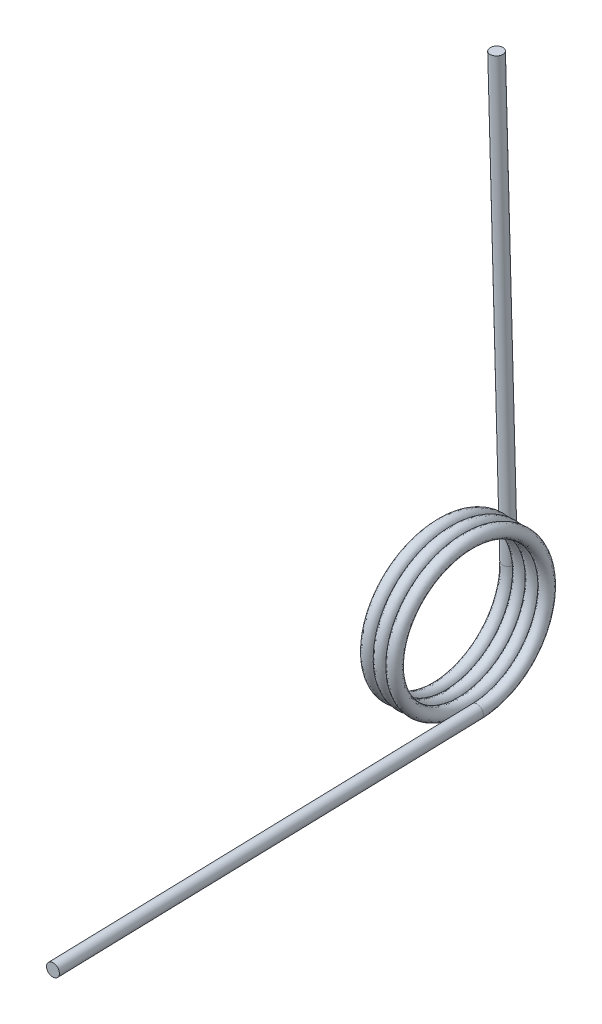
ISO-10303-21;
HEADER;
FILE_DESCRIPTION(('STEP AP214'),'2;1');
FILE_NAME('part.step','',(''),(''),'','','');
FILE_SCHEMA(('AUTOMOTIVE_DESIGN { 1 0 10303 214 1 1 1 1 }'));
ENDSEC;
DATA;
#1=APPLICATION_CONTEXT('core data for automotive mechanical design processes');
#2=APPLICATION_PROTOCOL_DEFINITION('international standard','automotive_design',2000,#1);
#3=PRODUCT_CONTEXT('',#1,'mechanical');
#4=PRODUCT('Part','Part','',(#3));
#5=PRODUCT_RELATED_PRODUCT_CATEGORY('part','',(#4));
#6=PRODUCT_DEFINITION_FORMATION('','',#4);
#7=PRODUCT_DEFINITION_CONTEXT('part definition',#1,'design');
#8=PRODUCT_DEFINITION('design','',#6,#7);
#9=PRODUCT_DEFINITION_SHAPE('','',#8);
#10=(LENGTH_UNIT() NAMED_UNIT(*) SI_UNIT(.MILLI.,.METRE.));
#11=(NAMED_UNIT(*) PLANE_ANGLE_UNIT() SI_UNIT($,.RADIAN.));
#12=(NAMED_UNIT(*) SI_UNIT($,.STERADIAN.) SOLID_ANGLE_UNIT());
#13=UNCERTAINTY_MEASURE_WITH_UNIT(LENGTH_MEASURE(1.E-05),#10,'distance_accuracy_value','');
#14=(GEOMETRIC_REPRESENTATION_CONTEXT(3) GLOBAL_UNCERTAINTY_ASSIGNED_CONTEXT((#13)) GLOBAL_UNIT_ASSIGNED_CONTEXT((#10,
#11,#12)) REPRESENTATION_CONTEXT('',''));
#15=CARTESIAN_POINT('',(0.,0.,0.));
#16=DIRECTION('',(0.,0.,1.));
#17=DIRECTION('',(1.,0.,0.));
#18=AXIS2_PLACEMENT_3D('',#15,#16,#17);
#19=CARTESIAN_POINT('',(1.45994168900246,0.0403796323984389,-16.9545));
#20=CARTESIAN_POINT('',(1.7054750223358,-9.74830550657707,-16.977813191635));
#21=CARTESIAN_POINT('',(1.95100835566913,-14.662837892264,-8.51221978745253));
#22=CARTESIAN_POINT('',(2.19654168900246,-19.577370277951,-0.0466263832700349));
#23=CARTESIAN_POINT('',(2.4420750223358,-14.7032175246625,8.44228021254747));
#24=CARTESIAN_POINT('',(2.68760835566913,-9.82906477137395,16.931186808365));
#25=CARTESIAN_POINT('',(2.93314168900246,-0.040379632398441,16.9545));
#26=CARTESIAN_POINT('',(3.17867502233579,9.74830550657706,16.977813191635));
#27=CARTESIAN_POINT('',(3.42420835566913,14.662837892264,8.51221978745253));
#28=CARTESIAN_POINT('',(3.66974168900246,19.577370277951,0.0466263832700373));
#29=CARTESIAN_POINT('',(3.91527502233579,14.7032175246625,-8.44228021254746));
#30=CARTESIAN_POINT('',(4.16080835566913,9.82906477137396,-16.931186808365));
#31=CARTESIAN_POINT('',(4.40634168900246,0.0403796323984389,-16.9545));
#32=CARTESIAN_POINT('',(4.65187502233579,-9.74830550657707,-16.977813191635));
#33=CARTESIAN_POINT('',(4.89740835566912,-14.662837892264,-8.51221978745253));
#34=CARTESIAN_POINT('',(5.14294168900246,-19.577370277951,-0.0466263832700349));
#35=CARTESIAN_POINT('',(5.38847502233579,-14.7032175246625,8.44228021254747));
#36=CARTESIAN_POINT('',(5.63400835566912,-9.82906477137395,16.931186808365));
#37=CARTESIAN_POINT('',(5.87954168900245,-0.040379632398441,16.9545));
#38=CARTESIAN_POINT('',(6.12507502233579,9.74830550657706,16.977813191635));
#39=CARTESIAN_POINT('',(6.37060835566912,14.662837892264,8.51221978745253));
#40=CARTESIAN_POINT('',(6.61614168900245,19.577370277951,0.0466263832700373));
#41=CARTESIAN_POINT('',(6.86167502233579,14.7032175246625,-8.44228021254746));
#42=CARTESIAN_POINT('',(7.10720835566912,9.82906477137396,-16.931186808365));
#43=CARTESIAN_POINT('',(7.35274168900245,0.0403796323984389,-16.9545));
#44=CARTESIAN_POINT('',(7.59827502233579,-9.74830550657707,-16.977813191635));
#45=CARTESIAN_POINT('',(7.84380835566912,-14.662837892264,-8.51221978745253));
#46=CARTESIAN_POINT('',(8.08934168900245,-19.577370277951,-0.0466263832700349));
#47=CARTESIAN_POINT('',(8.33487502233578,-14.7032175246625,8.44228021254747));
#48=CARTESIAN_POINT('',(8.58040835566912,-9.82906477137395,16.931186808365));
#49=CARTESIAN_POINT('',(8.82594168900245,-0.040379632398441,16.9545));
#50=CARTESIAN_POINT('',(9.07147502233578,9.74830550657706,16.977813191635));
#51=CARTESIAN_POINT('',(9.31700835566911,14.662837892264,8.51221978745253));
#52=CARTESIAN_POINT('',(9.56254168900245,19.577370277951,0.0466263832700373));
#53=CARTESIAN_POINT('',(9.80807502233578,14.7032175246625,-8.44228021254746));
#54=CARTESIAN_POINT('',(10.0536083556691,9.82906477137396,-16.931186808365));
#55=CARTESIAN_POINT('',(10.2991416890024,0.0403796323984389,-16.9545));
#56=CARTESIAN_POINT('',(10.5446750223358,-9.74830550657707,-16.977813191635));
#57=CARTESIAN_POINT('',(10.7902083556691,-14.662837892264,-8.51221978745253));
#58=CARTESIAN_POINT('',(11.0357416890024,-19.577370277951,-0.0466263832700349));
#59=CARTESIAN_POINT('',(11.2812750223358,-14.7032175246625,8.44228021254747));
#60=CARTESIAN_POINT('',(11.5268083556691,-9.82906477137395,16.931186808365));
#61=CARTESIAN_POINT('',(11.7723416890024,-0.040379632398441,16.9545));
#62=CARTESIAN_POINT('',(12.0178750223358,9.74830550657706,16.977813191635));
#63=CARTESIAN_POINT('',(12.2634083556691,14.662837892264,8.51221978745253));
#64=CARTESIAN_POINT('',(12.5089416890024,19.577370277951,0.0466263832700373));
#65=CARTESIAN_POINT('',(12.7544750223358,14.7032175246625,-8.44228021254746));
#66=CARTESIAN_POINT('',(13.0000083556691,9.82906477137396,-16.931186808365));
#67=CARTESIAN_POINT('',(13.2455416890024,0.0403796323984389,-16.9545));
#68=CARTESIAN_POINT('',(1.45994168900246,0.0403796323984389,-14.0335));
#69=CARTESIAN_POINT('',(1.7054750223358,-8.06186537027417,-14.056813191635));
#70=CARTESIAN_POINT('',(1.95100835566913,-12.1331776878097,-7.05171978745253));
#71=CARTESIAN_POINT('',(2.19654168900246,-16.2044900053452,-0.0466263832700347));
#72=CARTESIAN_POINT('',(2.4420750223358,-12.1735573202081,6.98178021254747));
#73=CARTESIAN_POINT('',(2.68760835566913,-8.14262463507106,14.010186808365));
#74=CARTESIAN_POINT('',(2.93314168900246,-0.0403796323984407,14.0335));
#75=CARTESIAN_POINT('',(3.17867502233579,8.06186537027417,14.056813191635));
#76=CARTESIAN_POINT('',(3.42420835566913,12.1331776878097,7.05171978745253));
#77=CARTESIAN_POINT('',(3.66974168900246,16.2044900053452,0.0466263832700367));
#78=CARTESIAN_POINT('',(3.91527502233579,12.1735573202081,-6.98178021254746));
#79=CARTESIAN_POINT('',(4.16080835566913,8.14262463507106,-14.010186808365));
#80=CARTESIAN_POINT('',(4.40634168900246,0.0403796323984389,-14.0335));
#81=CARTESIAN_POINT('',(4.65187502233579,-8.06186537027417,-14.056813191635));
#82=CARTESIAN_POINT('',(4.89740835566912,-12.1331776878097,-7.05171978745253));
#83=CARTESIAN_POINT('',(5.14294168900246,-16.2044900053452,-0.0466263832700347));
#84=CARTESIAN_POINT('',(5.38847502233579,-12.1735573202081,6.98178021254747));
#85=CARTESIAN_POINT('',(5.63400835566912,-8.14262463507106,14.010186808365));
#86=CARTESIAN_POINT('',(5.87954168900245,-0.0403796323984407,14.0335));
#87=CARTESIAN_POINT('',(6.12507502233579,8.06186537027417,14.056813191635));
#88=CARTESIAN_POINT('',(6.37060835566912,12.1331776878097,7.05171978745253));
#89=CARTESIAN_POINT('',(6.61614168900245,16.2044900053452,0.0466263832700367));
#90=CARTESIAN_POINT('',(6.86167502233579,12.1735573202081,-6.98178021254746));
#91=CARTESIAN_POINT('',(7.10720835566912,8.14262463507106,-14.010186808365));
#92=CARTESIAN_POINT('',(7.35274168900245,0.0403796323984389,-14.0335));
#93=CARTESIAN_POINT('',(7.59827502233579,-8.06186537027417,-14.056813191635));
#94=CARTESIAN_POINT('',(7.84380835566912,-12.1331776878097,-7.05171978745253));
#95=CARTESIAN_POINT('',(8.08934168900245,-16.2044900053452,-0.0466263832700347));
#96=CARTESIAN_POINT('',(8.33487502233578,-12.1735573202081,6.98178021254747));
#97=CARTESIAN_POINT('',(8.58040835566912,-8.14262463507106,14.010186808365));
#98=CARTESIAN_POINT('',(8.82594168900245,-0.0403796323984407,14.0335));
#99=CARTESIAN_POINT('',(9.07147502233578,8.06186537027417,14.056813191635));
#100=CARTESIAN_POINT('',(9.31700835566911,12.1331776878097,7.05171978745253));
#101=CARTESIAN_POINT('',(9.56254168900245,16.2044900053452,0.0466263832700367));
#102=CARTESIAN_POINT('',(9.80807502233578,12.1735573202081,-6.98178021254746));
#103=CARTESIAN_POINT('',(10.0536083556691,8.14262463507106,-14.010186808365));
#104=CARTESIAN_POINT('',(10.2991416890024,0.0403796323984389,-14.0335));
#105=CARTESIAN_POINT('',(10.5446750223358,-8.06186537027417,-14.056813191635));
#106=CARTESIAN_POINT('',(10.7902083556691,-12.1331776878097,-7.05171978745253));
#107=CARTESIAN_POINT('',(11.0357416890024,-16.2044900053452,-0.0466263832700347));
#108=CARTESIAN_POINT('',(11.2812750223358,-12.1735573202081,6.98178021254747));
#109=CARTESIAN_POINT('',(11.5268083556691,-8.14262463507106,14.010186808365));
#110=CARTESIAN_POINT('',(11.7723416890024,-0.0403796323984407,14.0335));
#111=CARTESIAN_POINT('',(12.0178750223358,8.06186537027417,14.056813191635));
#112=CARTESIAN_POINT('',(12.2634083556691,12.1331776878097,7.05171978745253));
#113=CARTESIAN_POINT('',(12.5089416890024,16.2044900053452,0.0466263832700367));
#114=CARTESIAN_POINT('',(12.7544750223358,12.1735573202081,-6.98178021254746));
#115=CARTESIAN_POINT('',(13.0000083556691,8.14262463507106,-14.010186808365));
#116=CARTESIAN_POINT('',(13.2455416890024,0.0403796323984389,-14.0335));
#117=CARTESIAN_POINT('',(-1.45994168900246,-0.0403796323984389,-14.0335));
#118=CARTESIAN_POINT('',(-1.21440835566913,-8.14262463507105,-14.010186808365));
#119=CARTESIAN_POINT('',(-0.968875022335798,-12.1735573202081,-6.98178021254748));
#120=CARTESIAN_POINT('',(-0.723341689002466,-16.2044900053452,0.0466263832700327));
#121=CARTESIAN_POINT('',(-0.477808355669133,-12.1331776878097,7.05171978745252));
#122=CARTESIAN_POINT('',(-0.2322750223358,-8.06186537027418,14.056813191635));
#123=CARTESIAN_POINT('',(0.013258310997533,0.0403796323984372,14.0335));
#124=CARTESIAN_POINT('',(0.258791644330866,8.14262463507105,14.010186808365));
#125=CARTESIAN_POINT('',(0.504324977664198,12.1735573202081,6.98178021254748));
#126=CARTESIAN_POINT('',(0.749858310997531,16.2044900053452,-0.0466263832700307));
#127=CARTESIAN_POINT('',(0.995391644330864,12.1331776878097,-7.05171978745252));
#128=CARTESIAN_POINT('',(1.2409249776642,8.06186537027418,-14.056813191635));
#129=CARTESIAN_POINT('',(1.48645831099753,-0.0403796323984389,-14.0335));
#130=CARTESIAN_POINT('',(1.73199164433086,-8.14262463507105,-14.010186808365));
#131=CARTESIAN_POINT('',(1.9775249776642,-12.1735573202081,-6.98178021254748));
#132=CARTESIAN_POINT('',(2.22305831099753,-16.2044900053452,0.0466263832700327));
#133=CARTESIAN_POINT('',(2.46859164433086,-12.1331776878097,7.05171978745252));
#134=CARTESIAN_POINT('',(2.71412497766419,-8.06186537027418,14.056813191635));
#135=CARTESIAN_POINT('',(2.95965831099753,0.0403796323984372,14.0335));
#136=CARTESIAN_POINT('',(3.20519164433086,8.14262463507105,14.010186808365));
#137=CARTESIAN_POINT('',(3.45072497766419,12.1735573202081,6.98178021254748));
#138=CARTESIAN_POINT('',(3.69625831099753,16.2044900053452,-0.0466263832700307));
#139=CARTESIAN_POINT('',(3.94179164433086,12.1331776878097,-7.05171978745252));
#140=CARTESIAN_POINT('',(4.18732497766419,8.06186537027418,-14.056813191635));
#141=CARTESIAN_POINT('',(4.43285831099752,-0.0403796323984389,-14.0335));
#142=CARTESIAN_POINT('',(4.67839164433086,-8.14262463507105,-14.010186808365));
#143=CARTESIAN_POINT('',(4.92392497766419,-12.1735573202081,-6.98178021254748));
#144=CARTESIAN_POINT('',(5.16945831099752,-16.2044900053452,0.0466263832700327));
#145=CARTESIAN_POINT('',(5.41499164433086,-12.1331776878097,7.05171978745252));
#146=CARTESIAN_POINT('',(5.66052497766419,-8.06186537027418,14.056813191635));
#147=CARTESIAN_POINT('',(5.90605831099752,0.0403796323984372,14.0335));
#148=CARTESIAN_POINT('',(6.15159164433085,8.14262463507105,14.010186808365));
#149=CARTESIAN_POINT('',(6.39712497766419,12.1735573202081,6.98178021254748));
#150=CARTESIAN_POINT('',(6.64265831099752,16.2044900053452,-0.0466263832700307));
#151=CARTESIAN_POINT('',(6.88819164433085,12.1331776878097,-7.05171978745252));
#152=CARTESIAN_POINT('',(7.13372497766419,8.06186537027418,-14.056813191635));
#153=CARTESIAN_POINT('',(7.37925831099752,-0.0403796323984389,-14.0335));
#154=CARTESIAN_POINT('',(7.62479164433085,-8.14262463507105,-14.010186808365));
#155=CARTESIAN_POINT('',(7.87032497766418,-12.1735573202081,-6.98178021254748));
#156=CARTESIAN_POINT('',(8.11585831099752,-16.2044900053452,0.0466263832700327));
#157=CARTESIAN_POINT('',(8.36139164433085,-12.1331776878097,7.05171978745252));
#158=CARTESIAN_POINT('',(8.60692497766418,-8.06186537027418,14.056813191635));
#159=CARTESIAN_POINT('',(8.85245831099751,0.0403796323984372,14.0335));
#160=CARTESIAN_POINT('',(9.09799164433085,8.14262463507105,14.010186808365));
#161=CARTESIAN_POINT('',(9.34352497766418,12.1735573202081,6.98178021254748));
#162=CARTESIAN_POINT('',(9.58905831099751,16.2044900053452,-0.0466263832700307));
#163=CARTESIAN_POINT('',(9.83459164433085,12.1331776878097,-7.05171978745252));
#164=CARTESIAN_POINT('',(10.0801249776642,8.06186537027418,-14.056813191635));
#165=CARTESIAN_POINT('',(10.3256583109975,-0.0403796323984389,-14.0335));
#166=CARTESIAN_POINT('',(-1.45994168900246,-0.0403796323984389,-16.9545));
#167=CARTESIAN_POINT('',(-1.21440835566913,-9.82906477137395,-16.931186808365));
#168=CARTESIAN_POINT('',(-0.968875022335799,-14.7032175246625,-8.44228021254748));
#169=CARTESIAN_POINT('',(-0.723341689002466,-19.577370277951,0.0466263832700325));
#170=CARTESIAN_POINT('',(-0.477808355669133,-14.662837892264,8.51221978745252));
#171=CARTESIAN_POINT('',(-0.2322750223358,-9.74830550657708,16.977813191635));
#172=CARTESIAN_POINT('',(0.0132583109975326,0.0403796323984369,16.9545));
#173=CARTESIAN_POINT('',(0.258791644330865,9.82906477137394,16.931186808365));
#174=CARTESIAN_POINT('',(0.504324977664198,14.7032175246625,8.44228021254748));
#175=CARTESIAN_POINT('',(0.749858310997531,19.577370277951,-0.0466263832700301));
#176=CARTESIAN_POINT('',(0.995391644330864,14.6628378922641,-8.51221978745251));
#177=CARTESIAN_POINT('',(1.2409249776642,9.74830550657708,-16.977813191635));
#178=CARTESIAN_POINT('',(1.48645831099753,-0.0403796323984389,-16.9545));
#179=CARTESIAN_POINT('',(1.73199164433086,-9.82906477137395,-16.931186808365));
#180=CARTESIAN_POINT('',(1.97752497766419,-14.7032175246625,-8.44228021254748));
#181=CARTESIAN_POINT('',(2.22305831099753,-19.577370277951,0.0466263832700325));
#182=CARTESIAN_POINT('',(2.46859164433086,-14.662837892264,8.51221978745252));
#183=CARTESIAN_POINT('',(2.71412497766419,-9.74830550657708,16.977813191635));
#184=CARTESIAN_POINT('',(2.95965831099753,0.0403796323984369,16.9545));
#185=CARTESIAN_POINT('',(3.20519164433086,9.82906477137394,16.931186808365));
#186=CARTESIAN_POINT('',(3.45072497766419,14.7032175246625,8.44228021254748));
#187=CARTESIAN_POINT('',(3.69625831099752,19.577370277951,-0.0466263832700301));
#188=CARTESIAN_POINT('',(3.94179164433086,14.6628378922641,-8.51221978745251));
#189=CARTESIAN_POINT('',(4.18732497766419,9.74830550657708,-16.977813191635));
#190=CARTESIAN_POINT('',(4.43285831099752,-0.0403796323984389,-16.9545));
#191=CARTESIAN_POINT('',(4.67839164433086,-9.82906477137395,-16.931186808365));
#192=CARTESIAN_POINT('',(4.92392497766419,-14.7032175246625,-8.44228021254748));
#193=CARTESIAN_POINT('',(5.16945831099752,-19.577370277951,0.0466263832700325));
#194=CARTESIAN_POINT('',(5.41499164433085,-14.662837892264,8.51221978745252));
#195=CARTESIAN_POINT('',(5.66052497766419,-9.74830550657708,16.977813191635));
#196=CARTESIAN_POINT('',(5.90605831099752,0.0403796323984369,16.9545));
#197=CARTESIAN_POINT('',(6.15159164433085,9.82906477137394,16.931186808365));
#198=CARTESIAN_POINT('',(6.39712497766418,14.7032175246625,8.44228021254748));
#199=CARTESIAN_POINT('',(6.64265831099752,19.577370277951,-0.0466263832700301));
#200=CARTESIAN_POINT('',(6.88819164433085,14.6628378922641,-8.51221978745251));
#201=CARTESIAN_POINT('',(7.13372497766418,9.74830550657708,-16.977813191635));
#202=CARTESIAN_POINT('',(7.37925831099752,-0.0403796323984389,-16.9545));
#203=CARTESIAN_POINT('',(7.62479164433085,-9.82906477137395,-16.931186808365));
#204=CARTESIAN_POINT('',(7.87032497766418,-14.7032175246625,-8.44228021254748));
#205=CARTESIAN_POINT('',(8.11585831099752,-19.577370277951,0.0466263832700325));
#206=CARTESIAN_POINT('',(8.36139164433085,-14.662837892264,8.51221978745252));
#207=CARTESIAN_POINT('',(8.60692497766418,-9.74830550657708,16.977813191635));
#208=CARTESIAN_POINT('',(8.85245831099751,0.0403796323984369,16.9545));
#209=CARTESIAN_POINT('',(9.09799164433085,9.82906477137394,16.931186808365));
#210=CARTESIAN_POINT('',(9.34352497766418,14.7032175246625,8.44228021254748));
#211=CARTESIAN_POINT('',(9.58905831099751,19.577370277951,-0.0466263832700301));
#212=CARTESIAN_POINT('',(9.83459164433085,14.6628378922641,-8.51221978745251));
#213=CARTESIAN_POINT('',(10.0801249776642,9.74830550657708,-16.977813191635));
#214=CARTESIAN_POINT('',(10.3256583109975,-0.0403796323984389,-16.9545));
#215=CARTESIAN_POINT('',(-1.45994168900246,-0.0403796323984389,-19.8755));
#216=CARTESIAN_POINT('',(-1.21440835566913,-11.5155049076768,-19.852186808365));
#217=CARTESIAN_POINT('',(-0.968875022335799,-17.2328777291168,-9.90278021254748));
#218=CARTESIAN_POINT('',(-0.723341689002466,-22.9502505505568,0.0466263832700323));
#219=CARTESIAN_POINT('',(-0.477808355669134,-17.1924980967184,9.97271978745252));
#220=CARTESIAN_POINT('',(-0.232275022335801,-11.43474564288,19.898813191635));
#221=CARTESIAN_POINT('',(0.0132583109975321,0.0403796323984365,19.8755));
#222=CARTESIAN_POINT('',(0.258791644330865,11.5155049076768,19.852186808365));
#223=CARTESIAN_POINT('',(0.504324977664198,17.2328777291168,9.90278021254748));
#224=CARTESIAN_POINT('',(0.749858310997531,22.9502505505568,-0.0466263832700295));
#225=CARTESIAN_POINT('',(0.995391644330863,17.1924980967184,-9.97271978745251));
#226=CARTESIAN_POINT('',(1.2409249776642,11.43474564288,-19.898813191635));
#227=CARTESIAN_POINT('',(1.48645831099753,-0.0403796323984389,-19.8755));
#228=CARTESIAN_POINT('',(1.73199164433086,-11.5155049076768,-19.852186808365));
#229=CARTESIAN_POINT('',(1.97752497766419,-17.2328777291168,-9.90278021254748));
#230=CARTESIAN_POINT('',(2.22305831099753,-22.9502505505568,0.0466263832700323));
#231=CARTESIAN_POINT('',(2.46859164433086,-17.1924980967184,9.97271978745252));
#232=CARTESIAN_POINT('',(2.71412497766419,-11.43474564288,19.898813191635));
#233=CARTESIAN_POINT('',(2.95965831099753,0.0403796323984365,19.8755));
#234=CARTESIAN_POINT('',(3.20519164433086,11.5155049076768,19.852186808365));
#235=CARTESIAN_POINT('',(3.45072497766419,17.2328777291168,9.90278021254748));
#236=CARTESIAN_POINT('',(3.69625831099752,22.9502505505568,-0.0466263832700295));
#237=CARTESIAN_POINT('',(3.94179164433086,17.1924980967184,-9.97271978745251));
#238=CARTESIAN_POINT('',(4.18732497766419,11.43474564288,-19.898813191635));
#239=CARTESIAN_POINT('',(4.43285831099752,-0.0403796323984389,-19.8755));
#240=CARTESIAN_POINT('',(4.67839164433086,-11.5155049076768,-19.852186808365));
#241=CARTESIAN_POINT('',(4.92392497766419,-17.2328777291168,-9.90278021254748));
#242=CARTESIAN_POINT('',(5.16945831099752,-22.9502505505568,0.0466263832700323));
#243=CARTESIAN_POINT('',(5.41499164433085,-17.1924980967184,9.97271978745252));
#244=CARTESIAN_POINT('',(5.66052497766419,-11.43474564288,19.898813191635));
#245=CARTESIAN_POINT('',(5.90605831099752,0.0403796323984365,19.8755));
#246=CARTESIAN_POINT('',(6.15159164433085,11.5155049076768,19.852186808365));
#247=CARTESIAN_POINT('',(6.39712497766418,17.2328777291168,9.90278021254748));
#248=CARTESIAN_POINT('',(6.64265831099752,22.9502505505568,-0.0466263832700295));
#249=CARTESIAN_POINT('',(6.88819164433085,17.1924980967184,-9.97271978745251));
#250=CARTESIAN_POINT('',(7.13372497766418,11.43474564288,-19.898813191635));
#251=CARTESIAN_POINT('',(7.37925831099752,-0.0403796323984389,-19.8755));
#252=CARTESIAN_POINT('',(7.62479164433085,-11.5155049076768,-19.852186808365));
#253=CARTESIAN_POINT('',(7.87032497766418,-17.2328777291168,-9.90278021254748));
#254=CARTESIAN_POINT('',(8.11585831099752,-22.9502505505568,0.0466263832700323));
#255=CARTESIAN_POINT('',(8.36139164433085,-17.1924980967184,9.97271978745252));
#256=CARTESIAN_POINT('',(8.60692497766418,-11.43474564288,19.898813191635));
#257=CARTESIAN_POINT('',(8.85245831099751,0.0403796323984365,19.8755));
#258=CARTESIAN_POINT('',(9.09799164433085,11.5155049076768,19.852186808365));
#259=CARTESIAN_POINT('',(9.34352497766418,17.2328777291168,9.90278021254748));
#260=CARTESIAN_POINT('',(9.58905831099751,22.9502505505568,-0.0466263832700295));
#261=CARTESIAN_POINT('',(9.83459164433084,17.1924980967184,-9.97271978745251));
#262=CARTESIAN_POINT('',(10.0801249776642,11.43474564288,-19.898813191635));
#263=CARTESIAN_POINT('',(10.3256583109975,-0.0403796323984389,-19.8755));
#264=CARTESIAN_POINT('',(1.45994168900246,0.0403796323984389,-19.8755));
#265=CARTESIAN_POINT('',(1.7054750223358,-11.43474564288,-19.898813191635));
#266=CARTESIAN_POINT('',(1.95100835566913,-17.1924980967184,-9.97271978745253));
#267=CARTESIAN_POINT('',(2.19654168900246,-22.9502505505568,-0.0466263832700351));
#268=CARTESIAN_POINT('',(2.4420750223358,-17.2328777291168,9.90278021254747));
#269=CARTESIAN_POINT('',(2.68760835566913,-11.5155049076769,19.852186808365));
#270=CARTESIAN_POINT('',(2.93314168900246,-0.0403796323984414,19.8755));
#271=CARTESIAN_POINT('',(3.17867502233579,11.43474564288,19.898813191635));
#272=CARTESIAN_POINT('',(3.42420835566913,17.1924980967184,9.97271978745253));
#273=CARTESIAN_POINT('',(3.66974168900246,22.9502505505568,0.0466263832700379));
#274=CARTESIAN_POINT('',(3.91527502233579,17.2328777291168,-9.90278021254746));
#275=CARTESIAN_POINT('',(4.16080835566913,11.5155049076769,-19.852186808365));
#276=CARTESIAN_POINT('',(4.40634168900246,0.0403796323984389,-19.8755));
#277=CARTESIAN_POINT('',(4.65187502233579,-11.43474564288,-19.898813191635));
#278=CARTESIAN_POINT('',(4.89740835566912,-17.1924980967184,-9.97271978745253));
#279=CARTESIAN_POINT('',(5.14294168900246,-22.9502505505568,-0.0466263832700351));
#280=CARTESIAN_POINT('',(5.38847502233579,-17.2328777291168,9.90278021254747));
#281=CARTESIAN_POINT('',(5.63400835566912,-11.5155049076769,19.852186808365));
#282=CARTESIAN_POINT('',(5.87954168900245,-0.0403796323984414,19.8755));
#283=CARTESIAN_POINT('',(6.12507502233579,11.43474564288,19.898813191635));
#284=CARTESIAN_POINT('',(6.37060835566912,17.1924980967184,9.97271978745253));
#285=CARTESIAN_POINT('',(6.61614168900245,22.9502505505568,0.0466263832700379));
#286=CARTESIAN_POINT('',(6.86167502233579,17.2328777291168,-9.90278021254746));
#287=CARTESIAN_POINT('',(7.10720835566912,11.5155049076769,-19.852186808365));
#288=CARTESIAN_POINT('',(7.35274168900245,0.0403796323984389,-19.8755));
#289=CARTESIAN_POINT('',(7.59827502233579,-11.43474564288,-19.898813191635));
#290=CARTESIAN_POINT('',(7.84380835566912,-17.1924980967184,-9.97271978745253));
#291=CARTESIAN_POINT('',(8.08934168900245,-22.9502505505568,-0.0466263832700351));
#292=CARTESIAN_POINT('',(8.33487502233578,-17.2328777291168,9.90278021254747));
#293=CARTESIAN_POINT('',(8.58040835566912,-11.5155049076769,19.852186808365));
#294=CARTESIAN_POINT('',(8.82594168900245,-0.0403796323984414,19.8755));
#295=CARTESIAN_POINT('',(9.07147502233578,11.43474564288,19.898813191635));
#296=CARTESIAN_POINT('',(9.31700835566911,17.1924980967184,9.97271978745253));
#297=CARTESIAN_POINT('',(9.56254168900245,22.9502505505568,0.0466263832700379));
#298=CARTESIAN_POINT('',(9.80807502233578,17.2328777291168,-9.90278021254746));
#299=CARTESIAN_POINT('',(10.0536083556691,11.5155049076769,-19.852186808365));
#300=CARTESIAN_POINT('',(10.2991416890024,0.0403796323984389,-19.8755));
#301=CARTESIAN_POINT('',(10.5446750223358,-11.43474564288,-19.898813191635));
#302=CARTESIAN_POINT('',(10.7902083556691,-17.1924980967184,-9.97271978745253));
#303=CARTESIAN_POINT('',(11.0357416890024,-22.9502505505568,-0.0466263832700351));
#304=CARTESIAN_POINT('',(11.2812750223358,-17.2328777291168,9.90278021254747));
#305=CARTESIAN_POINT('',(11.5268083556691,-11.5155049076769,19.852186808365));
#306=CARTESIAN_POINT('',(11.7723416890024,-0.0403796323984414,19.8755));
#307=CARTESIAN_POINT('',(12.0178750223358,11.43474564288,19.898813191635));
#308=CARTESIAN_POINT('',(12.2634083556691,17.1924980967184,9.97271978745253));
#309=CARTESIAN_POINT('',(12.5089416890024,22.9502505505568,0.0466263832700379));
#310=CARTESIAN_POINT('',(12.7544750223358,17.2328777291168,-9.90278021254746));
#311=CARTESIAN_POINT('',(13.0000083556691,11.5155049076769,-19.852186808365));
#312=CARTESIAN_POINT('',(13.2455416890024,0.0403796323984389,-19.8755));
#313=CARTESIAN_POINT('',(1.45994168900246,0.0403796323984389,-16.9545));
#314=CARTESIAN_POINT('',(1.7054750223358,-9.74830550657707,-16.977813191635));
#315=CARTESIAN_POINT('',(1.95100835566913,-14.662837892264,-8.51221978745253));
#316=CARTESIAN_POINT('',(2.19654168900246,-19.577370277951,-0.0466263832700349));
#317=CARTESIAN_POINT('',(2.4420750223358,-14.7032175246625,8.44228021254747));
#318=CARTESIAN_POINT('',(2.68760835566913,-9.82906477137395,16.931186808365));
#319=CARTESIAN_POINT('',(2.93314168900246,-0.040379632398441,16.9545));
#320=CARTESIAN_POINT('',(3.17867502233579,9.74830550657706,16.977813191635));
#321=CARTESIAN_POINT('',(3.42420835566913,14.662837892264,8.51221978745253));
#322=CARTESIAN_POINT('',(3.66974168900246,19.577370277951,0.0466263832700373));
#323=CARTESIAN_POINT('',(3.91527502233579,14.7032175246625,-8.44228021254746));
#324=CARTESIAN_POINT('',(4.16080835566913,9.82906477137396,-16.931186808365));
#325=CARTESIAN_POINT('',(4.40634168900246,0.0403796323984389,-16.9545));
#326=CARTESIAN_POINT('',(4.65187502233579,-9.74830550657707,-16.977813191635));
#327=CARTESIAN_POINT('',(4.89740835566912,-14.662837892264,-8.51221978745253));
#328=CARTESIAN_POINT('',(5.14294168900246,-19.577370277951,-0.0466263832700349));
#329=CARTESIAN_POINT('',(5.38847502233579,-14.7032175246625,8.44228021254747));
#330=CARTESIAN_POINT('',(5.63400835566912,-9.82906477137395,16.931186808365));
#331=CARTESIAN_POINT('',(5.87954168900245,-0.040379632398441,16.9545));
#332=CARTESIAN_POINT('',(6.12507502233579,9.74830550657706,16.977813191635));
#333=CARTESIAN_POINT('',(6.37060835566912,14.662837892264,8.51221978745253));
#334=CARTESIAN_POINT('',(6.61614168900245,19.577370277951,0.0466263832700373));
#335=CARTESIAN_POINT('',(6.86167502233579,14.7032175246625,-8.44228021254746));
#336=CARTESIAN_POINT('',(7.10720835566912,9.82906477137396,-16.931186808365));
#337=CARTESIAN_POINT('',(7.35274168900245,0.0403796323984389,-16.9545));
#338=CARTESIAN_POINT('',(7.59827502233579,-9.74830550657707,-16.977813191635));
#339=CARTESIAN_POINT('',(7.84380835566912,-14.662837892264,-8.51221978745253));
#340=CARTESIAN_POINT('',(8.08934168900245,-19.577370277951,-0.0466263832700349));
#341=CARTESIAN_POINT('',(8.33487502233578,-14.7032175246625,8.44228021254747));
#342=CARTESIAN_POINT('',(8.58040835566912,-9.82906477137395,16.931186808365));
#343=CARTESIAN_POINT('',(8.82594168900245,-0.040379632398441,16.9545));
#344=CARTESIAN_POINT('',(9.07147502233578,9.74830550657706,16.977813191635));
#345=CARTESIAN_POINT('',(9.31700835566911,14.662837892264,8.51221978745253));
#346=CARTESIAN_POINT('',(9.56254168900245,19.577370277951,0.0466263832700373));
#347=CARTESIAN_POINT('',(9.80807502233578,14.7032175246625,-8.44228021254746));
#348=CARTESIAN_POINT('',(10.0536083556691,9.82906477137396,-16.931186808365));
#349=CARTESIAN_POINT('',(10.2991416890024,0.0403796323984389,-16.9545));
#350=CARTESIAN_POINT('',(10.5446750223358,-9.74830550657707,-16.977813191635));
#351=CARTESIAN_POINT('',(10.7902083556691,-14.662837892264,-8.51221978745253));
#352=CARTESIAN_POINT('',(11.0357416890024,-19.577370277951,-0.0466263832700349));
#353=CARTESIAN_POINT('',(11.2812750223358,-14.7032175246625,8.44228021254747));
#354=CARTESIAN_POINT('',(11.5268083556691,-9.82906477137395,16.931186808365));
#355=CARTESIAN_POINT('',(11.7723416890024,-0.040379632398441,16.9545));
#356=CARTESIAN_POINT('',(12.0178750223358,9.74830550657706,16.977813191635));
#357=CARTESIAN_POINT('',(12.2634083556691,14.662837892264,8.51221978745253));
#358=CARTESIAN_POINT('',(12.5089416890024,19.577370277951,0.0466263832700373));
#359=CARTESIAN_POINT('',(12.7544750223358,14.7032175246625,-8.44228021254746));
#360=CARTESIAN_POINT('',(13.0000083556691,9.82906477137396,-16.931186808365));
#361=CARTESIAN_POINT('',(13.2455416890024,0.0403796323984389,-16.9545));
#362=(BOUNDED_SURFACE() B_SPLINE_SURFACE(3,2,((#19,#20,#21,#22,#23,#24,#25,#26,#27,#28,#29,#30,
#31,#32,#33,#34,#35,#36,#37,#38,#39,#40,#41,#42,#43,#44,#45,#46,#47,#48,#49,#50,#51,#52,#53,#54,
#55,#56,#57,#58,#59,#60,#61,#62,#63,#64,#65,#66,#67),(#68,#69,#70,#71,#72,#73,#74,#75,#76,#77,
#78,#79,#80,#81,#82,#83,#84,#85,#86,#87,#88,#89,#90,#91,#92,#93,#94,#95,#96,#97,#98,#99,#100,
#101,#102,#103,#104,#105,#106,#107,#108,#109,#110,#111,#112,#113,#114,#115,#116),(#117,#118,
#119,#120,#121,#122,#123,#124,#125,#126,#127,#128,#129,#130,#131,#132,#133,#134,#135,#136,#137,
#138,#139,#140,#141,#142,#143,#144,#145,#146,#147,#148,#149,#150,#151,#152,#153,#154,#155,#156,
#157,#158,#159,#160,#161,#162,#163,#164,#165),(#166,#167,#168,#169,#170,#171,#172,#173,#174,
#175,#176,#177,#178,#179,#180,#181,#182,#183,#184,#185,#186,#187,#188,#189,#190,#191,#192,#193,
#194,#195,#196,#197,#198,#199,#200,#201,#202,#203,#204,#205,#206,#207,#208,#209,#210,#211,#212,
#213,#214),(#215,#216,#217,#218,#219,#220,#221,#222,#223,#224,#225,#226,#227,#228,#229,#230,
#231,#232,#233,#234,#235,#236,#237,#238,#239,#240,#241,#242,#243,#244,#245,#246,#247,#248,#249,
#250,#251,#252,#253,#254,#255,#256,#257,#258,#259,#260,#261,#262,#263),(#264,#265,#266,#267,
#268,#269,#270,#271,#272,#273,#274,#275,#276,#277,#278,#279,#280,#281,#282,#283,#284,#285,#286,
#287,#288,#289,#290,#291,#292,#293,#294,#295,#296,#297,#298,#299,#300,#301,#302,#303,#304,#305,
#306,#307,#308,#309,#310,#311,#312),(#313,#314,#315,#316,#317,#318,#319,#320,#321,#322,#323,
#324,#325,#326,#327,#328,#329,#330,#331,#332,#333,#334,#335,#336,#337,#338,#339,#340,#341,#342,
#343,#344,#345,#346,#347,#348,#349,#350,#351,#352,#353,#354,#355,#356,#357,#358,#359,#360,
#361)),.UNSPECIFIED.,.T.,.F.,.F.) B_SPLINE_SURFACE_WITH_KNOTS((4,3,4),(3,2,2,2,2,2,2,2,2,2,2,2,
2,2,2,2,2,2,2,2,2,2,2,2,3),(0.,0.5,1.),(0.,0.0416666666666667,0.0833333333333333,0.125,
0.166666666666667,0.208333333333333,0.25,0.291666666666667,0.333333333333333,0.375,
0.416666666666667,0.458333333333333,0.5,0.541666666666667,0.583333333333333,0.625,
0.666666666666667,0.708333333333333,0.75,0.791666666666667,0.833333333333333,0.875,
0.916666666666667,0.958333333333333,1.),
.UNSPECIFIED.) GEOMETRIC_REPRESENTATION_ITEM() RATIONAL_B_SPLINE_SURFACE(((1.,0.866025403784439,
1.,0.866025403784439,1.,0.866025403784439,1.,0.866025403784439,1.,0.866025403784439,1.,
0.866025403784439,1.,0.866025403784439,1.,0.866025403784439,1.,0.866025403784439,1.,
0.866025403784439,1.,0.866025403784439,1.,0.866025403784439,1.,0.866025403784439,1.,
0.866025403784439,1.,0.866025403784439,1.,0.866025403784439,1.,0.866025403784439,1.,
0.866025403784439,1.,0.866025403784439,1.,0.866025403784439,1.,0.866025403784439,1.,
0.866025403784439,1.,0.866025403784439,1.,0.866025403784439,1.),(0.333333333333333,
0.288675134594813,0.333333333333333,0.288675134594813,0.333333333333333,0.288675134594813,
0.333333333333333,0.288675134594813,0.333333333333333,0.288675134594813,0.333333333333333,
0.288675134594813,0.333333333333333,0.288675134594813,0.333333333333333,0.288675134594813,
0.333333333333333,0.288675134594813,0.333333333333333,0.288675134594813,0.333333333333333,
0.288675134594813,0.333333333333333,0.288675134594813,0.333333333333333,0.288675134594813,
0.333333333333333,0.288675134594813,0.333333333333333,0.288675134594813,0.333333333333333,
0.288675134594813,0.333333333333333,0.288675134594813,0.333333333333333,0.288675134594813,
0.333333333333333,0.288675134594813,0.333333333333333,0.288675134594813,0.333333333333333,
0.288675134594813,0.333333333333333,0.288675134594813,0.333333333333333,0.288675134594813,
0.333333333333333,0.288675134594813,0.333333333333333),(0.333333333333333,0.288675134594813,
0.333333333333333,0.288675134594813,0.333333333333333,0.288675134594813,0.333333333333333,
0.288675134594813,0.333333333333333,0.288675134594813,0.333333333333333,0.288675134594813,
0.333333333333333,0.288675134594813,0.333333333333333,0.288675134594813,0.333333333333333,
0.288675134594813,0.333333333333333,0.288675134594813,0.333333333333333,0.288675134594813,
0.333333333333333,0.288675134594813,0.333333333333333,0.288675134594813,0.333333333333333,
0.288675134594813,0.333333333333333,0.288675134594813,0.333333333333333,0.288675134594813,
0.333333333333333,0.288675134594813,0.333333333333333,0.288675134594813,0.333333333333333,
0.288675134594813,0.333333333333333,0.288675134594813,0.333333333333333,0.288675134594813,
0.333333333333333,0.288675134594813,0.333333333333333,0.288675134594813,0.333333333333333,
0.288675134594813,0.333333333333333),(1.,0.866025403784439,1.,0.866025403784439,1.,
0.866025403784439,1.,0.866025403784439,1.,0.866025403784439,1.,0.866025403784439,1.,
0.866025403784439,1.,0.866025403784439,1.,0.866025403784439,1.,0.866025403784439,1.,
0.866025403784439,1.,0.866025403784439,1.,0.866025403784439,1.,0.866025403784439,1.,
0.866025403784439,1.,0.866025403784439,1.,0.866025403784439,1.,0.866025403784439,1.,
0.866025403784439,1.,0.866025403784439,1.,0.866025403784439,1.,0.866025403784439,1.,
0.866025403784439,1.,0.866025403784439,1.),(0.333333333333333,0.288675134594813,
0.333333333333333,0.288675134594813,0.333333333333333,0.288675134594813,0.333333333333333,
0.288675134594813,0.333333333333333,0.288675134594813,0.333333333333333,0.288675134594813,
0.333333333333333,0.288675134594813,0.333333333333333,0.288675134594813,0.333333333333333,
0.288675134594813,0.333333333333333,0.288675134594813,0.333333333333333,0.288675134594813,
0.333333333333333,0.288675134594813,0.333333333333333,0.288675134594813,0.333333333333333,
0.288675134594813,0.333333333333333,0.288675134594813,0.333333333333333,0.288675134594813,
0.333333333333333,0.288675134594813,0.333333333333333,0.288675134594813,0.333333333333333,
0.288675134594813,0.333333333333333,0.288675134594813,0.333333333333333,0.288675134594813,
0.333333333333333,0.288675134594813,0.333333333333333,0.288675134594813,0.333333333333333,
0.288675134594813,0.333333333333333),(0.333333333333333,0.288675134594813,0.333333333333333,
0.288675134594813,0.333333333333333,0.288675134594813,0.333333333333333,0.288675134594813,
0.333333333333333,0.288675134594813,0.333333333333333,0.288675134594813,0.333333333333333,
0.288675134594813,0.333333333333333,0.288675134594813,0.333333333333333,0.288675134594813,
0.333333333333333,0.288675134594813,0.333333333333333,0.288675134594813,0.333333333333333,
0.288675134594813,0.333333333333333,0.288675134594813,0.333333333333333,0.288675134594813,
0.333333333333333,0.288675134594813,0.333333333333333,0.288675134594813,0.333333333333333,
0.288675134594813,0.333333333333333,0.288675134594813,0.333333333333333,0.288675134594813,
0.333333333333333,0.288675134594813,0.333333333333333,0.288675134594813,0.333333333333333,
0.288675134594813,0.333333333333333,0.288675134594813,0.333333333333333,0.288675134594813,
0.333333333333333),(1.,0.866025403784439,1.,0.866025403784439,1.,0.866025403784439,1.,
0.866025403784439,1.,0.866025403784439,1.,0.866025403784439,1.,0.866025403784439,1.,
0.866025403784439,1.,0.866025403784439,1.,0.866025403784439,1.,0.866025403784439,1.,
0.866025403784439,1.,0.866025403784439,1.,0.866025403784439,1.,0.866025403784439,1.,
0.866025403784439,1.,0.866025403784439,1.,0.866025403784439,1.,0.866025403784439,1.,
0.866025403784439,1.,0.866025403784439,1.,0.866025403784439,1.,0.866025403784439,1.,
0.866025403784439,1.))) REPRESENTATION_ITEM('') SURFACE());
#363=CARTESIAN_POINT('',(9.5758,-16.9545,7.99669406706018E-13));
#364=DIRECTION('',(0.0276478140352201,0.,0.999617726122879));
#365=DIRECTION('',(0.999617726122878,0.,-0.0276478140352201));
#366=AXIS2_PLACEMENT_3D('',#363,#364,#365);
#367=CIRCLE('',#366,1.4605);
#368=CARTESIAN_POINT('',(11.0357416890025,-16.9545,-0.0403796323976393));
#369=VERTEX_POINT('',#368);
#370=EDGE_CURVE('E10',#369,#369,#367,.T.);
#371=CARTESIAN_POINT('',(0.,0.,-16.9545));
#372=DIRECTION('',(0.0276478140352201,-0.999617726122879,0.));
#373=DIRECTION('',(0.999617726122878,0.0276478140352201,0.));
#374=AXIS2_PLACEMENT_3D('',#371,#372,#373);
#375=CIRCLE('',#374,1.4605);
#376=CARTESIAN_POINT('',(1.45994168900246,0.0403796323984389,-16.9545));
#377=VERTEX_POINT('',#376);
#378=EDGE_CURVE('E40',#377,#377,#375,.T.);
#379=ORIENTED_EDGE('',*,*,#370,.F.);
#380=EDGE_LOOP('',(#379));
#381=FACE_BOUND('',#380,.T.);
#382=ORIENTED_EDGE('',*,*,#378,.T.);
#383=EDGE_LOOP('',(#382));
#384=FACE_BOUND('',#383,.T.);
#385=ADVANCED_FACE('F32',(#381,#384),#362,.T.);
#386=CARTESIAN_POINT('',(-2.80901790597836,101.561160974084,-16.9545));
#387=DIRECTION('',(0.0276478140352201,-0.999617726122878,0.));
#388=DIRECTION('',(0.999617726122878,0.0276478140352201,0.));
#389=AXIS2_PLACEMENT_3D('',#386,#387,#388);
#390=CYLINDRICAL_SURFACE('',#389,1.4605);
#391=CARTESIAN_POINT('',(-2.80901790597836,101.561160974084,-16.9545));
#392=DIRECTION('',(-0.0276478140352201,0.999617726122879,0.));
#393=DIRECTION('',(-0.999617726122878,-0.0276478140352201,0.));
#394=AXIS2_PLACEMENT_3D('',#391,#392,#393);
#395=CIRCLE('',#394,1.4605);
#396=CARTESIAN_POINT('',(-4.26895959498083,101.520781341686,-16.9545));
#397=VERTEX_POINT('',#396);
#398=EDGE_CURVE('E44',#397,#397,#395,.T.);
#399=ORIENTED_EDGE('',*,*,#398,.F.);
#400=EDGE_LOOP('',(#399));
#401=FACE_BOUND('',#400,.T.);
#402=ORIENTED_EDGE('',*,*,#378,.F.);
#403=EDGE_LOOP('',(#402));
#404=FACE_BOUND('',#403,.T.);
#405=ADVANCED_FACE('F65',(#401,#404),#390,.T.);
#406=CARTESIAN_POINT('',(-2.80901790597836,101.561160974084,-16.9545));
#407=DIRECTION('',(-0.0276478140352201,0.999617726122879,0.));
#408=DIRECTION('',(-0.999617726122878,-0.0276478140352201,0.));
#409=AXIS2_PLACEMENT_3D('',#406,#407,#408);
#410=PLANE('',#409);
#411=ORIENTED_EDGE('',*,*,#398,.T.);
#412=EDGE_LOOP('',(#411));
#413=FACE_BOUND('',#412,.T.);
#414=ADVANCED_FACE('F58',(#413),#410,.T.);
#415=CARTESIAN_POINT('',(12.3848179059784,-16.9544999999952,101.561160974085));
#416=DIRECTION('',(-0.0276478140352201,0.,-0.999617726122878));
#417=DIRECTION('',(-0.999617726122878,0.,0.0276478140352201));
#418=AXIS2_PLACEMENT_3D('',#415,#416,#417);
#419=CYLINDRICAL_SURFACE('',#418,1.4605);
#420=CARTESIAN_POINT('',(12.3848179059784,-16.9544999999952,101.561160974085));
#421=DIRECTION('',(0.0276478140352201,0.,0.999617726122878));
#422=DIRECTION('',(0.999617726122878,0.,-0.0276478140352201));
#423=AXIS2_PLACEMENT_3D('',#420,#421,#422);
#424=CIRCLE('',#423,1.4605);
#425=CARTESIAN_POINT('',(13.8447595949808,-16.9544999999952,101.520781341687));
#426=VERTEX_POINT('',#425);
#427=EDGE_CURVE('E48',#426,#426,#424,.T.);
#428=ORIENTED_EDGE('',*,*,#427,.F.);
#429=EDGE_LOOP('',(#428));
#430=FACE_BOUND('',#429,.T.);
#431=ORIENTED_EDGE('',*,*,#370,.T.);
#432=EDGE_LOOP('',(#431));
#433=FACE_BOUND('',#432,.T.);
#434=ADVANCED_FACE('F56',(#430,#433),#419,.T.);
#435=CARTESIAN_POINT('',(12.3848179059784,-16.9544999999952,101.561160974085));
#436=DIRECTION('',(0.0276478140352201,0.,0.999617726122878));
#437=DIRECTION('',(0.999617726122878,0.,-0.0276478140352201));
#438=AXIS2_PLACEMENT_3D('',#435,#436,#437);
#439=PLANE('',#438);
#440=ORIENTED_EDGE('',*,*,#427,.T.);
#441=EDGE_LOOP('',(#440));
#442=FACE_BOUND('',#441,.T.);
#443=ADVANCED_FACE('F54',(#442),#439,.T.);
#444=CLOSED_SHELL('',(#385,#405,#414,#434,#443));
#445=MANIFOLD_SOLID_BREP('B2',#444);
#446=ADVANCED_BREP_SHAPE_REPRESENTATION('',(#18,#445),#14);
#447=SHAPE_DEFINITION_REPRESENTATION(#9,#446);
ENDSEC;
END-ISO-10303-21;
